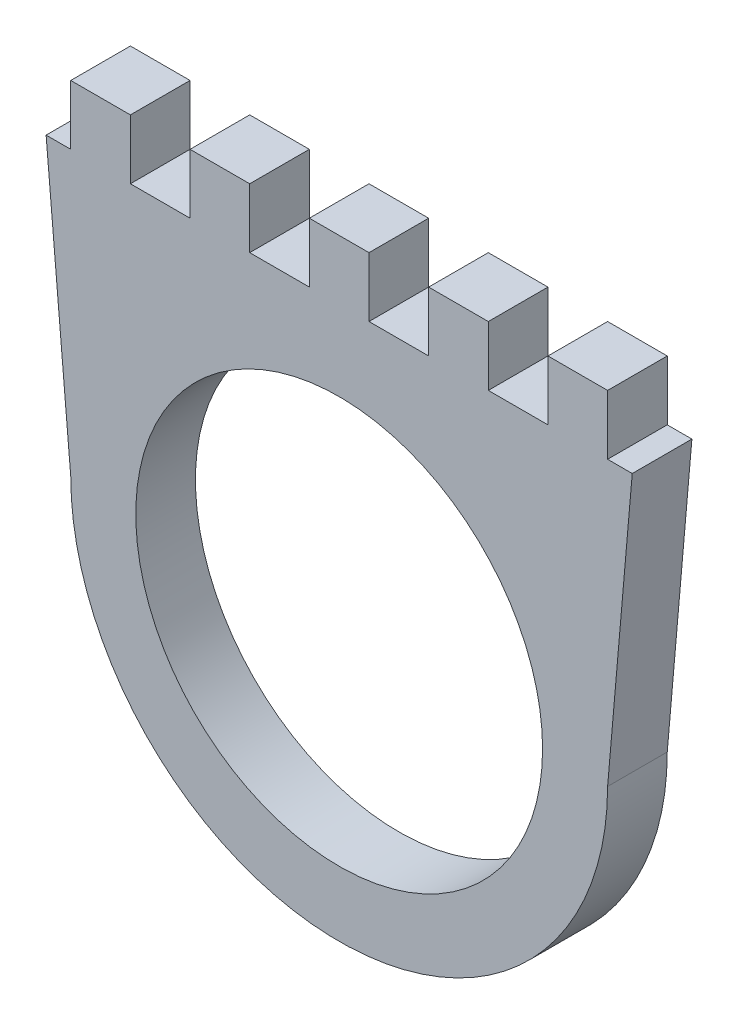
ISO-10303-21;
HEADER;
FILE_DESCRIPTION(('STEP AP214'),'2;1');
FILE_NAME('part.step','',(''),(''),'','','');
FILE_SCHEMA(('AUTOMOTIVE_DESIGN { 1 0 10303 214 1 1 1 1 }'));
ENDSEC;
DATA;
#1=APPLICATION_CONTEXT('core data for automotive mechanical design processes');
#2=APPLICATION_PROTOCOL_DEFINITION('international standard','automotive_design',2000,#1);
#3=PRODUCT_CONTEXT('',#1,'mechanical');
#4=PRODUCT('Part','Part','',(#3));
#5=PRODUCT_RELATED_PRODUCT_CATEGORY('part','',(#4));
#6=PRODUCT_DEFINITION_FORMATION('','',#4);
#7=PRODUCT_DEFINITION_CONTEXT('part definition',#1,'design');
#8=PRODUCT_DEFINITION('design','',#6,#7);
#9=PRODUCT_DEFINITION_SHAPE('','',#8);
#10=(LENGTH_UNIT() NAMED_UNIT(*) SI_UNIT(.MILLI.,.METRE.));
#11=(NAMED_UNIT(*) PLANE_ANGLE_UNIT() SI_UNIT($,.RADIAN.));
#12=(NAMED_UNIT(*) SI_UNIT($,.STERADIAN.) SOLID_ANGLE_UNIT());
#13=UNCERTAINTY_MEASURE_WITH_UNIT(LENGTH_MEASURE(1.E-05),#10,'distance_accuracy_value','');
#14=(GEOMETRIC_REPRESENTATION_CONTEXT(3) GLOBAL_UNCERTAINTY_ASSIGNED_CONTEXT((#13)) GLOBAL_UNIT_ASSIGNED_CONTEXT((#10,
#11,#12)) REPRESENTATION_CONTEXT('',''));
#15=CARTESIAN_POINT('',(0.,0.,0.));
#16=DIRECTION('',(0.,0.,1.));
#17=DIRECTION('',(1.,0.,0.));
#18=AXIS2_PLACEMENT_3D('',#15,#16,#17);
#19=CARTESIAN_POINT('',(-25.,28.75,5.));
#20=DIRECTION('',(0.,-1.,0.));
#21=DIRECTION('',(0.,0.,-1.));
#22=AXIS2_PLACEMENT_3D('',#19,#20,#21);
#23=PLANE('',#22);
#24=DIRECTION('',(-1.,0.,0.));
#25=VECTOR('',#24,1.);
#26=CARTESIAN_POINT('',(-25.,28.75,5.));
#27=LINE('',#26,#25);
#28=CARTESIAN_POINT('',(12.5,28.75,5.));
#29=VERTEX_POINT('',#28);
#30=CARTESIAN_POINT('',(7.5,28.75,5.));
#31=VERTEX_POINT('',#30);
#32=EDGE_CURVE('E315',#29,#31,#27,.T.);
#33=ORIENTED_EDGE('',*,*,#32,.F.);
#34=DIRECTION('',(0.,0.,1.));
#35=VECTOR('',#34,1.);
#36=CARTESIAN_POINT('',(12.5,28.75,-5.));
#37=LINE('',#36,#35);
#38=CARTESIAN_POINT('',(12.5,28.75,0.));
#39=VERTEX_POINT('',#38);
#40=EDGE_CURVE('E236',#39,#29,#37,.T.);
#41=ORIENTED_EDGE('',*,*,#40,.F.);
#42=DIRECTION('',(-1.,0.,0.));
#43=VECTOR('',#42,1.);
#44=CARTESIAN_POINT('',(-25.,28.75,0.));
#45=LINE('',#44,#43);
#46=CARTESIAN_POINT('',(7.5,28.75,0.));
#47=VERTEX_POINT('',#46);
#48=EDGE_CURVE('E326',#39,#47,#45,.T.);
#49=ORIENTED_EDGE('',*,*,#48,.T.);
#50=DIRECTION('',(0.,0.,1.));
#51=VECTOR('',#50,1.);
#52=CARTESIAN_POINT('',(7.5,28.75,-5.));
#53=LINE('',#52,#51);
#54=EDGE_CURVE('E257',#47,#31,#53,.T.);
#55=ORIENTED_EDGE('',*,*,#54,.T.);
#56=EDGE_LOOP('',(#33,#41,#49,#55));
#57=FACE_BOUND('',#56,.T.);
#58=ADVANCED_FACE('F32',(#57),#23,.F.);
#59=CARTESIAN_POINT('',(2.5,28.75,5.));
#60=VERTEX_POINT('',#59);
#61=CARTESIAN_POINT('',(-2.5,28.75,5.));
#62=VERTEX_POINT('',#61);
#63=EDGE_CURVE('E655',#60,#62,#27,.T.);
#64=ORIENTED_EDGE('',*,*,#63,.F.);
#65=DIRECTION('',(0.,0.,1.));
#66=VECTOR('',#65,1.);
#67=CARTESIAN_POINT('',(2.5,28.75,-5.));
#68=LINE('',#67,#66);
#69=CARTESIAN_POINT('',(2.5,28.75,0.));
#70=VERTEX_POINT('',#69);
#71=EDGE_CURVE('E254',#70,#60,#68,.T.);
#72=ORIENTED_EDGE('',*,*,#71,.F.);
#73=CARTESIAN_POINT('',(-2.5,28.75,0.));
#74=VERTEX_POINT('',#73);
#75=EDGE_CURVE('E634',#70,#74,#45,.T.);
#76=ORIENTED_EDGE('',*,*,#75,.T.);
#77=DIRECTION('',(0.,0.,1.));
#78=VECTOR('',#77,1.);
#79=CARTESIAN_POINT('',(-2.5,28.75,-5.));
#80=LINE('',#79,#78);
#81=EDGE_CURVE('E275',#74,#62,#80,.T.);
#82=ORIENTED_EDGE('',*,*,#81,.T.);
#83=EDGE_LOOP('',(#64,#72,#76,#82));
#84=FACE_BOUND('',#83,.T.);
#85=ADVANCED_FACE('F389',(#84),#23,.F.);
#86=CARTESIAN_POINT('',(-7.5,28.75,5.));
#87=VERTEX_POINT('',#86);
#88=CARTESIAN_POINT('',(-12.5,28.75,5.));
#89=VERTEX_POINT('',#88);
#90=EDGE_CURVE('E656',#87,#89,#27,.T.);
#91=ORIENTED_EDGE('',*,*,#90,.F.);
#92=DIRECTION('',(0.,0.,1.));
#93=VECTOR('',#92,1.);
#94=CARTESIAN_POINT('',(-7.5,28.75,-5.));
#95=LINE('',#94,#93);
#96=CARTESIAN_POINT('',(-7.5,28.75,0.));
#97=VERTEX_POINT('',#96);
#98=EDGE_CURVE('E272',#97,#87,#95,.T.);
#99=ORIENTED_EDGE('',*,*,#98,.F.);
#100=CARTESIAN_POINT('',(-12.5,28.75,0.));
#101=VERTEX_POINT('',#100);
#102=EDGE_CURVE('E633',#97,#101,#45,.T.);
#103=ORIENTED_EDGE('',*,*,#102,.T.);
#104=DIRECTION('',(0.,0.,1.));
#105=VECTOR('',#104,1.);
#106=CARTESIAN_POINT('',(-12.5,28.75,-5.));
#107=LINE('',#106,#105);
#108=EDGE_CURVE('E293',#101,#89,#107,.T.);
#109=ORIENTED_EDGE('',*,*,#108,.T.);
#110=EDGE_LOOP('',(#91,#99,#103,#109));
#111=FACE_BOUND('',#110,.T.);
#112=ADVANCED_FACE('F394',(#111),#23,.F.);
#113=CARTESIAN_POINT('',(-17.5,28.75,0.));
#114=VERTEX_POINT('',#113);
#115=CARTESIAN_POINT('',(-22.5,28.75,0.));
#116=VERTEX_POINT('',#115);
#117=EDGE_CURVE('E323',#114,#116,#45,.T.);
#118=ORIENTED_EDGE('',*,*,#117,.T.);
#119=DIRECTION('',(0.,0.,1.));
#120=VECTOR('',#119,1.);
#121=CARTESIAN_POINT('',(-22.5,28.75,5.));
#122=LINE('',#121,#120);
#123=CARTESIAN_POINT('',(-22.5,28.75,5.));
#124=VERTEX_POINT('',#123);
#125=EDGE_CURVE('E213',#116,#124,#122,.T.);
#126=ORIENTED_EDGE('',*,*,#125,.T.);
#127=CARTESIAN_POINT('',(-17.5,28.75,5.));
#128=VERTEX_POINT('',#127);
#129=EDGE_CURVE('E209',#128,#124,#27,.T.);
#130=ORIENTED_EDGE('',*,*,#129,.F.);
#131=DIRECTION('',(0.,0.,1.));
#132=VECTOR('',#131,1.);
#133=CARTESIAN_POINT('',(-17.5,28.75,-5.));
#134=LINE('',#133,#132);
#135=EDGE_CURVE('E290',#114,#128,#134,.T.);
#136=ORIENTED_EDGE('',*,*,#135,.F.);
#137=EDGE_LOOP('',(#118,#126,#130,#136));
#138=FACE_BOUND('',#137,.T.);
#139=ADVANCED_FACE('F387',(#138),#23,.F.);
#140=CARTESIAN_POINT('',(0.,0.,5.));
#141=DIRECTION('',(0.,0.,-1.));
#142=DIRECTION('',(-1.,0.,0.));
#143=AXIS2_PLACEMENT_3D('',#140,#141,#142);
#144=CYLINDRICAL_SURFACE('',#143,22.5);
#145=CARTESIAN_POINT('',(0.,0.,0.));
#146=DIRECTION('',(0.,0.,1.));
#147=DIRECTION('',(-1.,0.,0.));
#148=AXIS2_PLACEMENT_3D('',#145,#146,#147);
#149=CIRCLE('',#148,22.5);
#150=CARTESIAN_POINT('',(-22.5,0.,0.));
#151=VERTEX_POINT('',#150);
#152=CARTESIAN_POINT('',(22.5,0.,0.));
#153=VERTEX_POINT('',#152);
#154=EDGE_CURVE('E302',#151,#153,#149,.T.);
#155=ORIENTED_EDGE('',*,*,#154,.T.);
#156=DIRECTION('',(0.,0.,-1.));
#157=VECTOR('',#156,1.);
#158=CARTESIAN_POINT('',(22.5,0.,5.));
#159=LINE('',#158,#157);
#160=CARTESIAN_POINT('',(22.5,0.,5.));
#161=VERTEX_POINT('',#160);
#162=EDGE_CURVE('E330',#161,#153,#159,.T.);
#163=ORIENTED_EDGE('',*,*,#162,.F.);
#164=CARTESIAN_POINT('',(0.,0.,5.));
#165=DIRECTION('',(0.,0.,1.));
#166=DIRECTION('',(-1.,0.,0.));
#167=AXIS2_PLACEMENT_3D('',#164,#165,#166);
#168=CIRCLE('',#167,22.5);
#169=CARTESIAN_POINT('',(-22.5,0.,5.));
#170=VERTEX_POINT('',#169);
#171=EDGE_CURVE('E305',#170,#161,#168,.T.);
#172=ORIENTED_EDGE('',*,*,#171,.F.);
#173=DIRECTION('',(0.,0.,-1.));
#174=VECTOR('',#173,1.);
#175=CARTESIAN_POINT('',(-22.5,0.,5.));
#176=LINE('',#175,#174);
#177=EDGE_CURVE('E317',#170,#151,#176,.T.);
#178=ORIENTED_EDGE('',*,*,#177,.T.);
#179=EDGE_LOOP('',(#155,#163,#172,#178));
#180=FACE_BOUND('',#179,.T.);
#181=ADVANCED_FACE('F34',(#180),#144,.T.);
#182=CARTESIAN_POINT('',(25.,28.75,5.));
#183=DIRECTION('',(-0.996240588195683,0.0866296163648422,0.));
#184=DIRECTION('',(-0.0866296163648422,-0.996240588195683,0.));
#185=AXIS2_PLACEMENT_3D('',#182,#183,#184);
#186=PLANE('',#185);
#187=DIRECTION('',(0.0866296163648422,0.996240588195683,0.));
#188=VECTOR('',#187,1.);
#189=CARTESIAN_POINT('',(25.,28.75,0.));
#190=LINE('',#189,#188);
#191=CARTESIAN_POINT('',(24.5652173913044,23.75,0.));
#192=VERTEX_POINT('',#191);
#193=EDGE_CURVE('E320',#153,#192,#190,.T.);
#194=ORIENTED_EDGE('',*,*,#193,.T.);
#195=DIRECTION('',(0.,0.,1.));
#196=VECTOR('',#195,1.);
#197=CARTESIAN_POINT('',(24.5652173913044,23.75,5.));
#198=LINE('',#197,#196);
#199=CARTESIAN_POINT('',(24.5652173913044,23.75,5.));
#200=VERTEX_POINT('',#199);
#201=EDGE_CURVE('E54',#192,#200,#198,.T.);
#202=ORIENTED_EDGE('',*,*,#201,.T.);
#203=DIRECTION('',(0.0866296163648422,0.996240588195683,0.));
#204=VECTOR('',#203,1.);
#205=CARTESIAN_POINT('',(25.,28.75,5.));
#206=LINE('',#205,#204);
#207=EDGE_CURVE('E308',#161,#200,#206,.T.);
#208=ORIENTED_EDGE('',*,*,#207,.F.);
#209=ORIENTED_EDGE('',*,*,#162,.T.);
#210=EDGE_LOOP('',(#194,#202,#208,#209));
#211=FACE_BOUND('',#210,.T.);
#212=ADVANCED_FACE('F378',(#211),#186,.F.);
#213=CARTESIAN_POINT('',(22.5,28.75,5.));
#214=VERTEX_POINT('',#213);
#215=CARTESIAN_POINT('',(17.5,28.75,5.));
#216=VERTEX_POINT('',#215);
#217=EDGE_CURVE('E312',#214,#216,#27,.T.);
#218=ORIENTED_EDGE('',*,*,#217,.F.);
#219=DIRECTION('',(0.,0.,-1.));
#220=VECTOR('',#219,1.);
#221=CARTESIAN_POINT('',(22.5,28.75,5.));
#222=LINE('',#221,#220);
#223=CARTESIAN_POINT('',(22.5,28.75,0.));
#224=VERTEX_POINT('',#223);
#225=EDGE_CURVE('E223',#214,#224,#222,.T.);
#226=ORIENTED_EDGE('',*,*,#225,.T.);
#227=CARTESIAN_POINT('',(17.5,28.75,0.));
#228=VERTEX_POINT('',#227);
#229=EDGE_CURVE('E324',#224,#228,#45,.T.);
#230=ORIENTED_EDGE('',*,*,#229,.T.);
#231=DIRECTION('',(0.,0.,1.));
#232=VECTOR('',#231,1.);
#233=CARTESIAN_POINT('',(17.5,28.75,-5.));
#234=LINE('',#233,#232);
#235=EDGE_CURVE('E239',#228,#216,#234,.T.);
#236=ORIENTED_EDGE('',*,*,#235,.T.);
#237=EDGE_LOOP('',(#218,#226,#230,#236));
#238=FACE_BOUND('',#237,.T.);
#239=ADVANCED_FACE('F380',(#238),#23,.F.);
#240=CARTESIAN_POINT('',(-22.5,0.,5.));
#241=DIRECTION('',(0.996240588195683,0.086629616364842,0.));
#242=DIRECTION('',(-0.086629616364842,0.996240588195683,0.));
#243=AXIS2_PLACEMENT_3D('',#240,#241,#242);
#244=PLANE('',#243);
#245=DIRECTION('',(0.086629616364842,-0.996240588195683,0.));
#246=VECTOR('',#245,1.);
#247=CARTESIAN_POINT('',(-22.5,0.,5.));
#248=LINE('',#247,#246);
#249=CARTESIAN_POINT('',(-24.5652173913043,23.75,5.));
#250=VERTEX_POINT('',#249);
#251=EDGE_CURVE('E314',#250,#170,#248,.T.);
#252=ORIENTED_EDGE('',*,*,#251,.F.);
#253=DIRECTION('',(0.,0.,-1.));
#254=VECTOR('',#253,1.);
#255=CARTESIAN_POINT('',(-24.5652173913043,23.75,5.));
#256=LINE('',#255,#254);
#257=CARTESIAN_POINT('',(-24.5652173913043,23.75,0.));
#258=VERTEX_POINT('',#257);
#259=EDGE_CURVE('E196',#250,#258,#256,.T.);
#260=ORIENTED_EDGE('',*,*,#259,.T.);
#261=DIRECTION('',(0.086629616364842,-0.996240588195683,0.));
#262=VECTOR('',#261,1.);
#263=CARTESIAN_POINT('',(-22.5,0.,0.));
#264=LINE('',#263,#262);
#265=EDGE_CURVE('E309',#258,#151,#264,.T.);
#266=ORIENTED_EDGE('',*,*,#265,.T.);
#267=ORIENTED_EDGE('',*,*,#177,.F.);
#268=EDGE_LOOP('',(#252,#260,#266,#267));
#269=FACE_BOUND('',#268,.T.);
#270=ADVANCED_FACE('F367',(#269),#244,.F.);
#271=CARTESIAN_POINT('',(0.,0.,5.));
#272=DIRECTION('',(0.,0.,-1.));
#273=DIRECTION('',(-1.,0.,0.));
#274=AXIS2_PLACEMENT_3D('',#271,#272,#273);
#275=PLANE('',#274);
#276=CARTESIAN_POINT('',(0.,0.,5.));
#277=DIRECTION('',(0.,0.,1.));
#278=DIRECTION('',(1.,0.,0.));
#279=AXIS2_PLACEMENT_3D('',#276,#277,#278);
#280=CIRCLE('',#279,17.05);
#281=CARTESIAN_POINT('',(17.05,0.,5.));
#282=VERTEX_POINT('',#281);
#283=EDGE_CURVE('E292',#282,#282,#280,.T.);
#284=ORIENTED_EDGE('',*,*,#283,.F.);
#285=EDGE_LOOP('',(#284));
#286=FACE_BOUND('',#285,.T.);
#287=ORIENTED_EDGE('',*,*,#129,.T.);
#288=DIRECTION('',(0.,1.,0.));
#289=VECTOR('',#288,1.);
#290=CARTESIAN_POINT('',(-22.5,57.0618341169347,5.));
#291=LINE('',#290,#289);
#292=CARTESIAN_POINT('',(-22.5,23.75,5.));
#293=VERTEX_POINT('',#292);
#294=EDGE_CURVE('E192',#293,#124,#291,.T.);
#295=ORIENTED_EDGE('',*,*,#294,.F.);
#296=DIRECTION('',(1.,0.,0.));
#297=VECTOR('',#296,1.);
#298=CARTESIAN_POINT('',(-32.5805556571861,23.75,5.));
#299=LINE('',#298,#297);
#300=EDGE_CURVE('E199',#250,#293,#299,.T.);
#301=ORIENTED_EDGE('',*,*,#300,.F.);
#302=ORIENTED_EDGE('',*,*,#251,.T.);
#303=ORIENTED_EDGE('',*,*,#171,.T.);
#304=ORIENTED_EDGE('',*,*,#207,.T.);
#305=DIRECTION('',(1.,0.,0.));
#306=VECTOR('',#305,1.);
#307=CARTESIAN_POINT('',(22.5,23.75,5.));
#308=LINE('',#307,#306);
#309=CARTESIAN_POINT('',(22.5,23.75,5.));
#310=VERTEX_POINT('',#309);
#311=EDGE_CURVE('E217',#310,#200,#308,.T.);
#312=ORIENTED_EDGE('',*,*,#311,.F.);
#313=DIRECTION('',(0.,-1.,0.));
#314=VECTOR('',#313,1.);
#315=CARTESIAN_POINT('',(22.5,38.0076766484123,5.));
#316=LINE('',#315,#314);
#317=EDGE_CURVE('E215',#214,#310,#316,.T.);
#318=ORIENTED_EDGE('',*,*,#317,.F.);
#319=ORIENTED_EDGE('',*,*,#217,.T.);
#320=DIRECTION('',(0.,1.,0.));
#321=VECTOR('',#320,1.);
#322=CARTESIAN_POINT('',(17.5,28.75,5.));
#323=LINE('',#322,#321);
#324=CARTESIAN_POINT('',(17.5,23.75,5.));
#325=VERTEX_POINT('',#324);
#326=EDGE_CURVE('E232',#325,#216,#323,.T.);
#327=ORIENTED_EDGE('',*,*,#326,.F.);
#328=DIRECTION('',(1.,0.,0.));
#329=VECTOR('',#328,1.);
#330=CARTESIAN_POINT('',(12.5,23.75,5.));
#331=LINE('',#330,#329);
#332=CARTESIAN_POINT('',(12.5,23.75,5.));
#333=VERTEX_POINT('',#332);
#334=EDGE_CURVE('E229',#333,#325,#331,.T.);
#335=ORIENTED_EDGE('',*,*,#334,.F.);
#336=DIRECTION('',(0.,-1.,0.));
#337=VECTOR('',#336,1.);
#338=CARTESIAN_POINT('',(12.5,28.75,5.));
#339=LINE('',#338,#337);
#340=EDGE_CURVE('E226',#29,#333,#339,.T.);
#341=ORIENTED_EDGE('',*,*,#340,.F.);
#342=ORIENTED_EDGE('',*,*,#32,.T.);
#343=DIRECTION('',(0.,1.,0.));
#344=VECTOR('',#343,1.);
#345=CARTESIAN_POINT('',(7.5,28.75,5.));
#346=LINE('',#345,#344);
#347=CARTESIAN_POINT('',(7.5,23.75,5.));
#348=VERTEX_POINT('',#347);
#349=EDGE_CURVE('E250',#348,#31,#346,.T.);
#350=ORIENTED_EDGE('',*,*,#349,.F.);
#351=DIRECTION('',(1.,0.,0.));
#352=VECTOR('',#351,1.);
#353=CARTESIAN_POINT('',(2.5,23.75,5.));
#354=LINE('',#353,#352);
#355=CARTESIAN_POINT('',(2.5,23.75,5.));
#356=VERTEX_POINT('',#355);
#357=EDGE_CURVE('E247',#356,#348,#354,.T.);
#358=ORIENTED_EDGE('',*,*,#357,.F.);
#359=DIRECTION('',(0.,-1.,0.));
#360=VECTOR('',#359,1.);
#361=CARTESIAN_POINT('',(2.5,28.75,5.));
#362=LINE('',#361,#360);
#363=EDGE_CURVE('E238',#60,#356,#362,.T.);
#364=ORIENTED_EDGE('',*,*,#363,.F.);
#365=ORIENTED_EDGE('',*,*,#63,.T.);
#366=DIRECTION('',(0.,1.,0.));
#367=VECTOR('',#366,1.);
#368=CARTESIAN_POINT('',(-2.5,28.75,5.));
#369=LINE('',#368,#367);
#370=CARTESIAN_POINT('',(-2.5,23.75,5.));
#371=VERTEX_POINT('',#370);
#372=EDGE_CURVE('E268',#371,#62,#369,.T.);
#373=ORIENTED_EDGE('',*,*,#372,.F.);
#374=DIRECTION('',(1.,0.,0.));
#375=VECTOR('',#374,1.);
#376=CARTESIAN_POINT('',(-7.5,23.75,5.));
#377=LINE('',#376,#375);
#378=CARTESIAN_POINT('',(-7.5,23.75,5.));
#379=VERTEX_POINT('',#378);
#380=EDGE_CURVE('E265',#379,#371,#377,.T.);
#381=ORIENTED_EDGE('',*,*,#380,.F.);
#382=DIRECTION('',(0.,-1.,0.));
#383=VECTOR('',#382,1.);
#384=CARTESIAN_POINT('',(-7.5,28.75,5.));
#385=LINE('',#384,#383);
#386=EDGE_CURVE('E256',#87,#379,#385,.T.);
#387=ORIENTED_EDGE('',*,*,#386,.F.);
#388=ORIENTED_EDGE('',*,*,#90,.T.);
#389=DIRECTION('',(0.,1.,0.));
#390=VECTOR('',#389,1.);
#391=CARTESIAN_POINT('',(-12.5,28.75,5.));
#392=LINE('',#391,#390);
#393=CARTESIAN_POINT('',(-12.5,23.75,5.));
#394=VERTEX_POINT('',#393);
#395=EDGE_CURVE('E286',#394,#89,#392,.T.);
#396=ORIENTED_EDGE('',*,*,#395,.F.);
#397=DIRECTION('',(1.,0.,0.));
#398=VECTOR('',#397,1.);
#399=CARTESIAN_POINT('',(-17.5,23.75,5.));
#400=LINE('',#399,#398);
#401=CARTESIAN_POINT('',(-17.5,23.75,5.));
#402=VERTEX_POINT('',#401);
#403=EDGE_CURVE('E283',#402,#394,#400,.T.);
#404=ORIENTED_EDGE('',*,*,#403,.F.);
#405=DIRECTION('',(0.,-1.,0.));
#406=VECTOR('',#405,1.);
#407=CARTESIAN_POINT('',(-17.5,28.75,5.));
#408=LINE('',#407,#406);
#409=EDGE_CURVE('E274',#128,#402,#408,.T.);
#410=ORIENTED_EDGE('',*,*,#409,.F.);
#411=EDGE_LOOP('',(#287,#295,#301,#302,#303,#304,#312,#318,#319,#327,#335,#341,#342,#350,#358,
#364,#365,#373,#381,#387,#388,#396,#404,#410));
#412=FACE_BOUND('',#411,.T.);
#413=ADVANCED_FACE('F206',(#286,#412),#275,.F.);
#414=CARTESIAN_POINT('',(0.,0.,0.));
#415=DIRECTION('',(0.,0.,-1.));
#416=DIRECTION('',(-1.,0.,0.));
#417=AXIS2_PLACEMENT_3D('',#414,#415,#416);
#418=PLANE('',#417);
#419=DIRECTION('',(0.,-1.,0.));
#420=VECTOR('',#419,1.);
#421=CARTESIAN_POINT('',(-22.5,0.,0.));
#422=LINE('',#421,#420);
#423=CARTESIAN_POINT('',(-22.5,23.75,0.));
#424=VERTEX_POINT('',#423);
#425=EDGE_CURVE('E11',#116,#424,#422,.T.);
#426=ORIENTED_EDGE('',*,*,#425,.F.);
#427=ORIENTED_EDGE('',*,*,#117,.F.);
#428=DIRECTION('',(0.,1.,0.));
#429=VECTOR('',#428,1.);
#430=CARTESIAN_POINT('',(-17.5,0.,0.));
#431=LINE('',#430,#429);
#432=CARTESIAN_POINT('',(-17.5,23.75,0.));
#433=VERTEX_POINT('',#432);
#434=EDGE_CURVE('E338',#433,#114,#431,.T.);
#435=ORIENTED_EDGE('',*,*,#434,.F.);
#436=DIRECTION('',(-1.,0.,0.));
#437=VECTOR('',#436,1.);
#438=CARTESIAN_POINT('',(0.,23.75,0.));
#439=LINE('',#438,#437);
#440=CARTESIAN_POINT('',(-12.5,23.75,0.));
#441=VERTEX_POINT('',#440);
#442=EDGE_CURVE('E333',#441,#433,#439,.T.);
#443=ORIENTED_EDGE('',*,*,#442,.F.);
#444=DIRECTION('',(0.,-1.,0.));
#445=VECTOR('',#444,1.);
#446=CARTESIAN_POINT('',(-12.5,0.,0.));
#447=LINE('',#446,#445);
#448=EDGE_CURVE('E335',#101,#441,#447,.T.);
#449=ORIENTED_EDGE('',*,*,#448,.F.);
#450=ORIENTED_EDGE('',*,*,#102,.F.);
#451=DIRECTION('',(0.,1.,0.));
#452=VECTOR('',#451,1.);
#453=CARTESIAN_POINT('',(-7.5,0.,0.));
#454=LINE('',#453,#452);
#455=CARTESIAN_POINT('',(-7.5,23.75,0.));
#456=VERTEX_POINT('',#455);
#457=EDGE_CURVE('E345',#456,#97,#454,.T.);
#458=ORIENTED_EDGE('',*,*,#457,.F.);
#459=DIRECTION('',(-1.,0.,0.));
#460=VECTOR('',#459,1.);
#461=CARTESIAN_POINT('',(0.,23.75,0.));
#462=LINE('',#461,#460);
#463=CARTESIAN_POINT('',(-2.5,23.75,0.));
#464=VERTEX_POINT('',#463);
#465=EDGE_CURVE('E340',#464,#456,#462,.T.);
#466=ORIENTED_EDGE('',*,*,#465,.F.);
#467=DIRECTION('',(0.,-1.,0.));
#468=VECTOR('',#467,1.);
#469=CARTESIAN_POINT('',(-2.49999999999999,0.,0.));
#470=LINE('',#469,#468);
#471=EDGE_CURVE('E342',#74,#464,#470,.T.);
#472=ORIENTED_EDGE('',*,*,#471,.F.);
#473=ORIENTED_EDGE('',*,*,#75,.F.);
#474=DIRECTION('',(0.,1.,0.));
#475=VECTOR('',#474,1.);
#476=CARTESIAN_POINT('',(2.5,0.,0.));
#477=LINE('',#476,#475);
#478=CARTESIAN_POINT('',(2.5,23.75,0.));
#479=VERTEX_POINT('',#478);
#480=EDGE_CURVE('E352',#479,#70,#477,.T.);
#481=ORIENTED_EDGE('',*,*,#480,.F.);
#482=DIRECTION('',(-1.,0.,0.));
#483=VECTOR('',#482,1.);
#484=CARTESIAN_POINT('',(0.,23.75,0.));
#485=LINE('',#484,#483);
#486=CARTESIAN_POINT('',(7.5,23.75,0.));
#487=VERTEX_POINT('',#486);
#488=EDGE_CURVE('E347',#487,#479,#485,.T.);
#489=ORIENTED_EDGE('',*,*,#488,.F.);
#490=DIRECTION('',(0.,-1.,0.));
#491=VECTOR('',#490,1.);
#492=CARTESIAN_POINT('',(7.50000000000001,0.,0.));
#493=LINE('',#492,#491);
#494=EDGE_CURVE('E349',#47,#487,#493,.T.);
#495=ORIENTED_EDGE('',*,*,#494,.F.);
#496=ORIENTED_EDGE('',*,*,#48,.F.);
#497=DIRECTION('',(0.,1.,0.));
#498=VECTOR('',#497,1.);
#499=CARTESIAN_POINT('',(12.5,0.,0.));
#500=LINE('',#499,#498);
#501=CARTESIAN_POINT('',(12.5,23.75,0.));
#502=VERTEX_POINT('',#501);
#503=EDGE_CURVE('E359',#502,#39,#500,.T.);
#504=ORIENTED_EDGE('',*,*,#503,.F.);
#505=DIRECTION('',(-1.,0.,0.));
#506=VECTOR('',#505,1.);
#507=CARTESIAN_POINT('',(0.,23.75,0.));
#508=LINE('',#507,#506);
#509=CARTESIAN_POINT('',(17.5,23.75,0.));
#510=VERTEX_POINT('',#509);
#511=EDGE_CURVE('E354',#510,#502,#508,.T.);
#512=ORIENTED_EDGE('',*,*,#511,.F.);
#513=DIRECTION('',(0.,-1.,0.));
#514=VECTOR('',#513,1.);
#515=CARTESIAN_POINT('',(17.5,0.,0.));
#516=LINE('',#515,#514);
#517=EDGE_CURVE('E356',#228,#510,#516,.T.);
#518=ORIENTED_EDGE('',*,*,#517,.F.);
#519=ORIENTED_EDGE('',*,*,#229,.F.);
#520=DIRECTION('',(0.,1.,0.));
#521=VECTOR('',#520,1.);
#522=CARTESIAN_POINT('',(22.5,0.,0.));
#523=LINE('',#522,#521);
#524=CARTESIAN_POINT('',(22.5,23.75,0.));
#525=VERTEX_POINT('',#524);
#526=EDGE_CURVE('E363',#525,#224,#523,.T.);
#527=ORIENTED_EDGE('',*,*,#526,.F.);
#528=DIRECTION('',(-1.,0.,0.));
#529=VECTOR('',#528,1.);
#530=CARTESIAN_POINT('',(0.,23.75,0.));
#531=LINE('',#530,#529);
#532=EDGE_CURVE('E361',#192,#525,#531,.T.);
#533=ORIENTED_EDGE('',*,*,#532,.F.);
#534=ORIENTED_EDGE('',*,*,#193,.F.);
#535=ORIENTED_EDGE('',*,*,#154,.F.);
#536=ORIENTED_EDGE('',*,*,#265,.F.);
#537=DIRECTION('',(-1.,0.,0.));
#538=VECTOR('',#537,1.);
#539=CARTESIAN_POINT('',(0.,23.75,0.));
#540=LINE('',#539,#538);
#541=EDGE_CURVE('E40',#424,#258,#540,.T.);
#542=ORIENTED_EDGE('',*,*,#541,.F.);
#543=EDGE_LOOP('',(#426,#427,#435,#443,#449,#450,#458,#466,#472,#473,#481,#489,#495,#496,#504,
#512,#518,#519,#527,#533,#534,#535,#536,#542));
#544=FACE_BOUND('',#543,.T.);
#545=CARTESIAN_POINT('',(0.,0.,0.));
#546=DIRECTION('',(0.,0.,1.));
#547=DIRECTION('',(1.,0.,0.));
#548=AXIS2_PLACEMENT_3D('',#545,#546,#547);
#549=CIRCLE('',#548,17.05);
#550=CARTESIAN_POINT('',(17.05,0.,0.));
#551=VERTEX_POINT('',#550);
#552=EDGE_CURVE('E299',#551,#551,#549,.T.);
#553=ORIENTED_EDGE('',*,*,#552,.T.);
#554=EDGE_LOOP('',(#553));
#555=FACE_BOUND('',#554,.T.);
#556=ADVANCED_FACE('F370',(#544,#555),#418,.T.);
#557=CARTESIAN_POINT('',(0.,0.,0.));
#558=DIRECTION('',(0.,0.,1.));
#559=DIRECTION('',(1.,0.,0.));
#560=AXIS2_PLACEMENT_3D('',#557,#558,#559);
#561=CYLINDRICAL_SURFACE('',#560,17.05);
#562=ORIENTED_EDGE('',*,*,#552,.F.);
#563=EDGE_LOOP('',(#562));
#564=FACE_BOUND('',#563,.T.);
#565=ORIENTED_EDGE('',*,*,#283,.T.);
#566=EDGE_LOOP('',(#565));
#567=FACE_BOUND('',#566,.T.);
#568=ADVANCED_FACE('F402',(#564,#567),#561,.F.);
#569=CARTESIAN_POINT('',(-17.5,28.75,-5.));
#570=DIRECTION('',(-1.,0.,0.));
#571=DIRECTION('',(0.,0.,1.));
#572=AXIS2_PLACEMENT_3D('',#569,#570,#571);
#573=PLANE('',#572);
#574=ORIENTED_EDGE('',*,*,#434,.T.);
#575=ORIENTED_EDGE('',*,*,#135,.T.);
#576=ORIENTED_EDGE('',*,*,#409,.T.);
#577=DIRECTION('',(0.,0.,1.));
#578=VECTOR('',#577,1.);
#579=CARTESIAN_POINT('',(-17.5,23.75,-5.));
#580=LINE('',#579,#578);
#581=EDGE_CURVE('E289',#433,#402,#580,.T.);
#582=ORIENTED_EDGE('',*,*,#581,.F.);
#583=EDGE_LOOP('',(#574,#575,#576,#582));
#584=FACE_BOUND('',#583,.T.);
#585=ADVANCED_FACE('F408',(#584),#573,.F.);
#586=CARTESIAN_POINT('',(-12.5,28.75,-5.));
#587=DIRECTION('',(1.,0.,0.));
#588=DIRECTION('',(0.,1.,0.));
#589=AXIS2_PLACEMENT_3D('',#586,#587,#588);
#590=PLANE('',#589);
#591=ORIENTED_EDGE('',*,*,#448,.T.);
#592=DIRECTION('',(0.,0.,1.));
#593=VECTOR('',#592,1.);
#594=CARTESIAN_POINT('',(-12.5,23.75,-5.));
#595=LINE('',#594,#593);
#596=EDGE_CURVE('E296',#441,#394,#595,.T.);
#597=ORIENTED_EDGE('',*,*,#596,.T.);
#598=ORIENTED_EDGE('',*,*,#395,.T.);
#599=ORIENTED_EDGE('',*,*,#108,.F.);
#600=EDGE_LOOP('',(#591,#597,#598,#599));
#601=FACE_BOUND('',#600,.T.);
#602=ADVANCED_FACE('F412',(#601),#590,.F.);
#603=CARTESIAN_POINT('',(-17.5,23.75,-5.));
#604=DIRECTION('',(0.,-1.,0.));
#605=DIRECTION('',(1.,0.,0.));
#606=AXIS2_PLACEMENT_3D('',#603,#604,#605);
#607=PLANE('',#606);
#608=ORIENTED_EDGE('',*,*,#442,.T.);
#609=ORIENTED_EDGE('',*,*,#581,.T.);
#610=ORIENTED_EDGE('',*,*,#403,.T.);
#611=ORIENTED_EDGE('',*,*,#596,.F.);
#612=EDGE_LOOP('',(#608,#609,#610,#611));
#613=FACE_BOUND('',#612,.T.);
#614=ADVANCED_FACE('F414',(#613),#607,.F.);
#615=CARTESIAN_POINT('',(-7.5,28.75,-5.));
#616=DIRECTION('',(-1.,0.,0.));
#617=DIRECTION('',(0.,0.,1.));
#618=AXIS2_PLACEMENT_3D('',#615,#616,#617);
#619=PLANE('',#618);
#620=ORIENTED_EDGE('',*,*,#457,.T.);
#621=ORIENTED_EDGE('',*,*,#98,.T.);
#622=ORIENTED_EDGE('',*,*,#386,.T.);
#623=DIRECTION('',(0.,0.,1.));
#624=VECTOR('',#623,1.);
#625=CARTESIAN_POINT('',(-7.5,23.75,-5.));
#626=LINE('',#625,#624);
#627=EDGE_CURVE('E271',#456,#379,#626,.T.);
#628=ORIENTED_EDGE('',*,*,#627,.F.);
#629=EDGE_LOOP('',(#620,#621,#622,#628));
#630=FACE_BOUND('',#629,.T.);
#631=ADVANCED_FACE('F417',(#630),#619,.F.);
#632=CARTESIAN_POINT('',(-2.5,28.75,-5.));
#633=DIRECTION('',(1.,0.,0.));
#634=DIRECTION('',(0.,1.,0.));
#635=AXIS2_PLACEMENT_3D('',#632,#633,#634);
#636=PLANE('',#635);
#637=ORIENTED_EDGE('',*,*,#471,.T.);
#638=DIRECTION('',(0.,0.,1.));
#639=VECTOR('',#638,1.);
#640=CARTESIAN_POINT('',(-2.5,23.75,-5.));
#641=LINE('',#640,#639);
#642=EDGE_CURVE('E278',#464,#371,#641,.T.);
#643=ORIENTED_EDGE('',*,*,#642,.T.);
#644=ORIENTED_EDGE('',*,*,#372,.T.);
#645=ORIENTED_EDGE('',*,*,#81,.F.);
#646=EDGE_LOOP('',(#637,#643,#644,#645));
#647=FACE_BOUND('',#646,.T.);
#648=ADVANCED_FACE('F424',(#647),#636,.F.);
#649=CARTESIAN_POINT('',(-7.5,23.75,-5.));
#650=DIRECTION('',(0.,-1.,0.));
#651=DIRECTION('',(1.,0.,0.));
#652=AXIS2_PLACEMENT_3D('',#649,#650,#651);
#653=PLANE('',#652);
#654=ORIENTED_EDGE('',*,*,#465,.T.);
#655=ORIENTED_EDGE('',*,*,#627,.T.);
#656=ORIENTED_EDGE('',*,*,#380,.T.);
#657=ORIENTED_EDGE('',*,*,#642,.F.);
#658=EDGE_LOOP('',(#654,#655,#656,#657));
#659=FACE_BOUND('',#658,.T.);
#660=ADVANCED_FACE('F426',(#659),#653,.F.);
#661=CARTESIAN_POINT('',(2.5,28.75,-5.));
#662=DIRECTION('',(-1.,0.,0.));
#663=DIRECTION('',(0.,0.,1.));
#664=AXIS2_PLACEMENT_3D('',#661,#662,#663);
#665=PLANE('',#664);
#666=ORIENTED_EDGE('',*,*,#480,.T.);
#667=ORIENTED_EDGE('',*,*,#71,.T.);
#668=ORIENTED_EDGE('',*,*,#363,.T.);
#669=DIRECTION('',(0.,0.,1.));
#670=VECTOR('',#669,1.);
#671=CARTESIAN_POINT('',(2.5,23.75,-5.));
#672=LINE('',#671,#670);
#673=EDGE_CURVE('E253',#479,#356,#672,.T.);
#674=ORIENTED_EDGE('',*,*,#673,.F.);
#675=EDGE_LOOP('',(#666,#667,#668,#674));
#676=FACE_BOUND('',#675,.T.);
#677=ADVANCED_FACE('F429',(#676),#665,.F.);
#678=CARTESIAN_POINT('',(7.5,28.75,-5.));
#679=DIRECTION('',(1.,0.,0.));
#680=DIRECTION('',(0.,1.,0.));
#681=AXIS2_PLACEMENT_3D('',#678,#679,#680);
#682=PLANE('',#681);
#683=ORIENTED_EDGE('',*,*,#494,.T.);
#684=DIRECTION('',(0.,0.,1.));
#685=VECTOR('',#684,1.);
#686=CARTESIAN_POINT('',(7.5,23.75,-5.));
#687=LINE('',#686,#685);
#688=EDGE_CURVE('E260',#487,#348,#687,.T.);
#689=ORIENTED_EDGE('',*,*,#688,.T.);
#690=ORIENTED_EDGE('',*,*,#349,.T.);
#691=ORIENTED_EDGE('',*,*,#54,.F.);
#692=EDGE_LOOP('',(#683,#689,#690,#691));
#693=FACE_BOUND('',#692,.T.);
#694=ADVANCED_FACE('F436',(#693),#682,.F.);
#695=CARTESIAN_POINT('',(2.5,23.75,-5.));
#696=DIRECTION('',(0.,-1.,0.));
#697=DIRECTION('',(1.,0.,0.));
#698=AXIS2_PLACEMENT_3D('',#695,#696,#697);
#699=PLANE('',#698);
#700=ORIENTED_EDGE('',*,*,#488,.T.);
#701=ORIENTED_EDGE('',*,*,#673,.T.);
#702=ORIENTED_EDGE('',*,*,#357,.T.);
#703=ORIENTED_EDGE('',*,*,#688,.F.);
#704=EDGE_LOOP('',(#700,#701,#702,#703));
#705=FACE_BOUND('',#704,.T.);
#706=ADVANCED_FACE('F438',(#705),#699,.F.);
#707=CARTESIAN_POINT('',(12.5,28.75,-5.));
#708=DIRECTION('',(-1.,0.,0.));
#709=DIRECTION('',(0.,0.,1.));
#710=AXIS2_PLACEMENT_3D('',#707,#708,#709);
#711=PLANE('',#710);
#712=ORIENTED_EDGE('',*,*,#503,.T.);
#713=ORIENTED_EDGE('',*,*,#40,.T.);
#714=ORIENTED_EDGE('',*,*,#340,.T.);
#715=DIRECTION('',(0.,0.,1.));
#716=VECTOR('',#715,1.);
#717=CARTESIAN_POINT('',(12.5,23.75,-5.));
#718=LINE('',#717,#716);
#719=EDGE_CURVE('E235',#502,#333,#718,.T.);
#720=ORIENTED_EDGE('',*,*,#719,.F.);
#721=EDGE_LOOP('',(#712,#713,#714,#720));
#722=FACE_BOUND('',#721,.T.);
#723=ADVANCED_FACE('F441',(#722),#711,.F.);
#724=CARTESIAN_POINT('',(17.5,28.75,-5.));
#725=DIRECTION('',(1.,0.,0.));
#726=DIRECTION('',(0.,1.,0.));
#727=AXIS2_PLACEMENT_3D('',#724,#725,#726);
#728=PLANE('',#727);
#729=ORIENTED_EDGE('',*,*,#517,.T.);
#730=DIRECTION('',(0.,0.,1.));
#731=VECTOR('',#730,1.);
#732=CARTESIAN_POINT('',(17.5,23.75,-5.));
#733=LINE('',#732,#731);
#734=EDGE_CURVE('E242',#510,#325,#733,.T.);
#735=ORIENTED_EDGE('',*,*,#734,.T.);
#736=ORIENTED_EDGE('',*,*,#326,.T.);
#737=ORIENTED_EDGE('',*,*,#235,.F.);
#738=EDGE_LOOP('',(#729,#735,#736,#737));
#739=FACE_BOUND('',#738,.T.);
#740=ADVANCED_FACE('F448',(#739),#728,.F.);
#741=CARTESIAN_POINT('',(12.5,23.75,-5.));
#742=DIRECTION('',(0.,-1.,0.));
#743=DIRECTION('',(1.,0.,0.));
#744=AXIS2_PLACEMENT_3D('',#741,#742,#743);
#745=PLANE('',#744);
#746=ORIENTED_EDGE('',*,*,#511,.T.);
#747=ORIENTED_EDGE('',*,*,#719,.T.);
#748=ORIENTED_EDGE('',*,*,#334,.T.);
#749=ORIENTED_EDGE('',*,*,#734,.F.);
#750=EDGE_LOOP('',(#746,#747,#748,#749));
#751=FACE_BOUND('',#750,.T.);
#752=ADVANCED_FACE('F450',(#751),#745,.F.);
#753=CARTESIAN_POINT('',(22.5,38.0076766484123,-5.));
#754=DIRECTION('',(-1.,0.,0.));
#755=DIRECTION('',(0.,-1.,0.));
#756=AXIS2_PLACEMENT_3D('',#753,#754,#755);
#757=PLANE('',#756);
#758=ORIENTED_EDGE('',*,*,#317,.T.);
#759=DIRECTION('',(0.,0.,1.));
#760=VECTOR('',#759,1.);
#761=CARTESIAN_POINT('',(22.5,23.75,-5.));
#762=LINE('',#761,#760);
#763=EDGE_CURVE('E219',#525,#310,#762,.T.);
#764=ORIENTED_EDGE('',*,*,#763,.F.);
#765=ORIENTED_EDGE('',*,*,#526,.T.);
#766=ORIENTED_EDGE('',*,*,#225,.F.);
#767=EDGE_LOOP('',(#758,#764,#765,#766));
#768=FACE_BOUND('',#767,.T.);
#769=ADVANCED_FACE('F453',(#768),#757,.F.);
#770=CARTESIAN_POINT('',(22.5,23.75,-5.));
#771=DIRECTION('',(0.,-1.,0.));
#772=DIRECTION('',(0.,0.,-1.));
#773=AXIS2_PLACEMENT_3D('',#770,#771,#772);
#774=PLANE('',#773);
#775=ORIENTED_EDGE('',*,*,#532,.T.);
#776=ORIENTED_EDGE('',*,*,#763,.T.);
#777=ORIENTED_EDGE('',*,*,#311,.T.);
#778=ORIENTED_EDGE('',*,*,#201,.F.);
#779=EDGE_LOOP('',(#775,#776,#777,#778));
#780=FACE_BOUND('',#779,.T.);
#781=ADVANCED_FACE('F460',(#780),#774,.F.);
#782=CARTESIAN_POINT('',(-22.5,57.0618341169347,-5.));
#783=DIRECTION('',(1.,0.,0.));
#784=DIRECTION('',(0.,1.,0.));
#785=AXIS2_PLACEMENT_3D('',#782,#783,#784);
#786=PLANE('',#785);
#787=ORIENTED_EDGE('',*,*,#425,.T.);
#788=DIRECTION('',(0.,0.,1.));
#789=VECTOR('',#788,1.);
#790=CARTESIAN_POINT('',(-22.5,23.75,-5.));
#791=LINE('',#790,#789);
#792=EDGE_CURVE('E47',#424,#293,#791,.T.);
#793=ORIENTED_EDGE('',*,*,#792,.T.);
#794=ORIENTED_EDGE('',*,*,#294,.T.);
#795=ORIENTED_EDGE('',*,*,#125,.F.);
#796=EDGE_LOOP('',(#787,#793,#794,#795));
#797=FACE_BOUND('',#796,.T.);
#798=ADVANCED_FACE('F190',(#797),#786,.F.);
#799=CARTESIAN_POINT('',(-32.5805556571861,23.75,-5.));
#800=DIRECTION('',(0.,-1.,0.));
#801=DIRECTION('',(0.,0.,-1.));
#802=AXIS2_PLACEMENT_3D('',#799,#800,#801);
#803=PLANE('',#802);
#804=ORIENTED_EDGE('',*,*,#300,.T.);
#805=ORIENTED_EDGE('',*,*,#792,.F.);
#806=ORIENTED_EDGE('',*,*,#541,.T.);
#807=ORIENTED_EDGE('',*,*,#259,.F.);
#808=EDGE_LOOP('',(#804,#805,#806,#807));
#809=FACE_BOUND('',#808,.T.);
#810=ADVANCED_FACE('F200',(#809),#803,.F.);
#811=CLOSED_SHELL('',(#58,#85,#112,#139,#181,#212,#239,#270,#413,#556,#568,#585,#602,#614,#631,
#648,#660,#677,#694,#706,#723,#740,#752,#769,#781,#798,#810));
#812=MANIFOLD_SOLID_BREP('B2',#811);
#813=ADVANCED_BREP_SHAPE_REPRESENTATION('',(#18,#812),#14);
#814=SHAPE_DEFINITION_REPRESENTATION(#9,#813);
ENDSEC;
END-ISO-10303-21;
